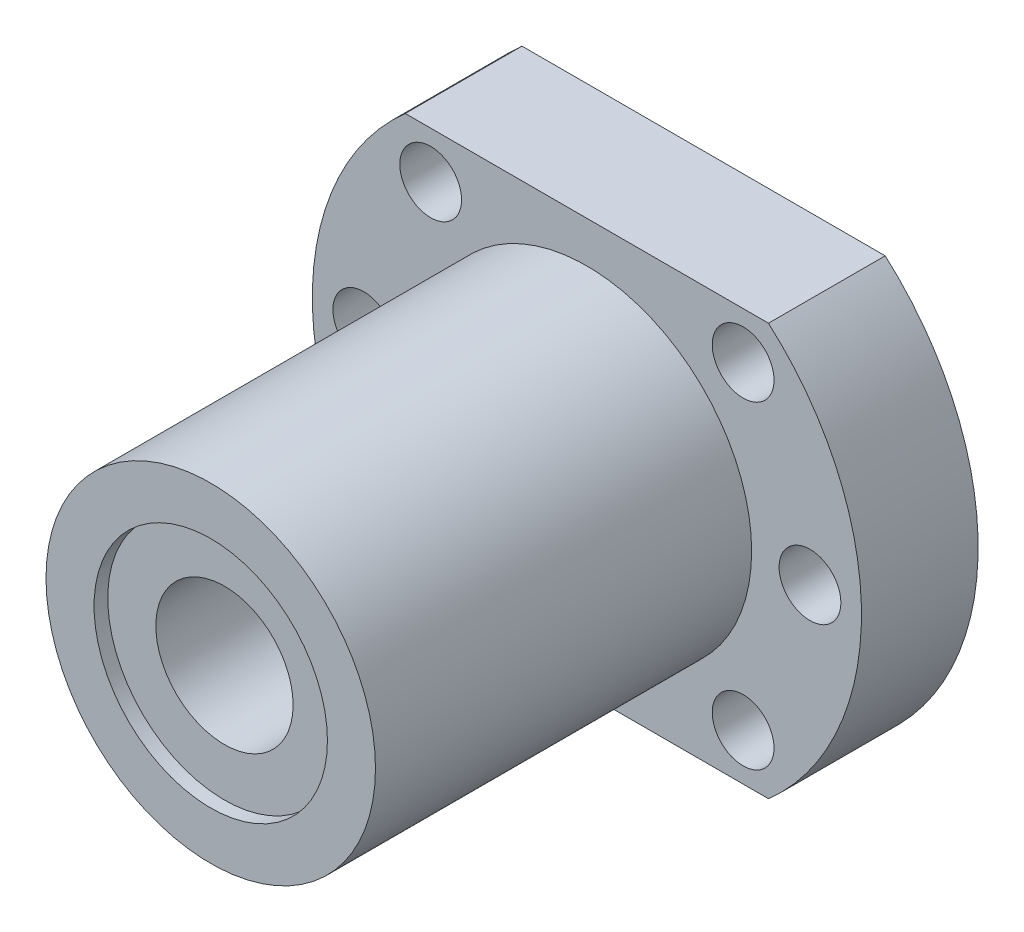
ISO-10303-21;
HEADER;
FILE_DESCRIPTION(('STEP AP214'),'2;1');
FILE_NAME('part.step','',(''),(''),'','','');
FILE_SCHEMA(('AUTOMOTIVE_DESIGN { 1 0 10303 214 1 1 1 1 }'));
ENDSEC;
DATA;
#1=APPLICATION_CONTEXT('core data for automotive mechanical design processes');
#2=APPLICATION_PROTOCOL_DEFINITION('international standard','automotive_design',2000,#1);
#3=PRODUCT_CONTEXT('',#1,'mechanical');
#4=PRODUCT('Part','Part','',(#3));
#5=PRODUCT_RELATED_PRODUCT_CATEGORY('part','',(#4));
#6=PRODUCT_DEFINITION_FORMATION('','',#4);
#7=PRODUCT_DEFINITION_CONTEXT('part definition',#1,'design');
#8=PRODUCT_DEFINITION('design','',#6,#7);
#9=PRODUCT_DEFINITION_SHAPE('','',#8);
#10=(LENGTH_UNIT() NAMED_UNIT(*) SI_UNIT(.MILLI.,.METRE.));
#11=(NAMED_UNIT(*) PLANE_ANGLE_UNIT() SI_UNIT($,.RADIAN.));
#12=(NAMED_UNIT(*) SI_UNIT($,.STERADIAN.) SOLID_ANGLE_UNIT());
#13=UNCERTAINTY_MEASURE_WITH_UNIT(LENGTH_MEASURE(1.E-05),#10,'distance_accuracy_value','');
#14=(GEOMETRIC_REPRESENTATION_CONTEXT(3) GLOBAL_UNCERTAINTY_ASSIGNED_CONTEXT((#13)) GLOBAL_UNIT_ASSIGNED_CONTEXT((#10,
#11,#12)) REPRESENTATION_CONTEXT('',''));
#15=CARTESIAN_POINT('',(0.,0.,0.));
#16=DIRECTION('',(0.,0.,1.));
#17=DIRECTION('',(1.,0.,0.));
#18=AXIS2_PLACEMENT_3D('',#15,#16,#17);
#19=CARTESIAN_POINT('',(0.,0.,-14.142135623731));
#20=DIRECTION('',(0.,0.,1.));
#21=DIRECTION('',(0.999999999999998,0.,0.));
#22=AXIS2_PLACEMENT_3D('',#19,#20,#21);
#23=CYLINDRICAL_SURFACE('',#22,5.);
#24=CARTESIAN_POINT('',(-1.11022302462516E-13,0.,34.9));
#25=DIRECTION('',(0.,0.,1.));
#26=DIRECTION('',(0.999999999999998,0.,0.));
#27=AXIS2_PLACEMENT_3D('',#24,#25,#26);
#28=CIRCLE('',#27,5.);
#29=CARTESIAN_POINT('',(4.99999999999988,0.,34.9));
#30=VERTEX_POINT('',#29);
#31=EDGE_CURVE('E116',#30,#30,#28,.F.);
#32=ORIENTED_EDGE('',*,*,#31,.F.);
#33=EDGE_LOOP('',(#32));
#34=FACE_BOUND('',#33,.T.);
#35=CARTESIAN_POINT('',(0.,0.,1.));
#36=DIRECTION('',(0.,0.,-1.));
#37=DIRECTION('',(-0.999999999999998,0.,0.));
#38=AXIS2_PLACEMENT_3D('',#35,#36,#37);
#39=CIRCLE('',#38,5.);
#40=CARTESIAN_POINT('',(-4.99999999999999,0.,1.));
#41=VERTEX_POINT('',#40);
#42=EDGE_CURVE('E42',#41,#41,#39,.F.);
#43=ORIENTED_EDGE('',*,*,#42,.F.);
#44=EDGE_LOOP('',(#43));
#45=FACE_BOUND('',#44,.T.);
#46=ADVANCED_FACE('F38',(#34,#45),#23,.F.);
#47=CARTESIAN_POINT('',(0.,0.,8.50000000000001));
#48=DIRECTION('',(0.,0.,-1.));
#49=DIRECTION('',(-0.999999999999998,0.,0.));
#50=AXIS2_PLACEMENT_3D('',#47,#48,#49);
#51=CYLINDRICAL_SURFACE('',#50,20.);
#52=CARTESIAN_POINT('',(0.,0.,0.));
#53=DIRECTION('',(0.,0.,1.));
#54=DIRECTION('',(0.999999999999998,0.,0.));
#55=AXIS2_PLACEMENT_3D('',#52,#53,#54);
#56=CIRCLE('',#55,20.);
#57=CARTESIAN_POINT('',(-13.228756555323,15.,0.));
#58=VERTEX_POINT('',#57);
#59=CARTESIAN_POINT('',(-13.2287565553229,-15.,0.));
#60=VERTEX_POINT('',#59);
#61=EDGE_CURVE('E107',#58,#60,#56,.T.);
#62=ORIENTED_EDGE('',*,*,#61,.T.);
#63=DIRECTION('',(0.,0.,-1.));
#64=VECTOR('',#63,1.);
#65=CARTESIAN_POINT('',(-13.228756555323,-15.,8.50000000000001));
#66=LINE('',#65,#64);
#67=CARTESIAN_POINT('',(-13.228756555323,-15.,8.50000000000001));
#68=VERTEX_POINT('',#67);
#69=EDGE_CURVE('E48',#68,#60,#66,.T.);
#70=ORIENTED_EDGE('',*,*,#69,.F.);
#71=CARTESIAN_POINT('',(0.,0.,8.50000000000001));
#72=DIRECTION('',(0.,0.,1.));
#73=DIRECTION('',(0.999999999999998,0.,0.));
#74=AXIS2_PLACEMENT_3D('',#71,#72,#73);
#75=CIRCLE('',#74,20.);
#76=CARTESIAN_POINT('',(-13.228756555323,15.,8.50000000000001));
#77=VERTEX_POINT('',#76);
#78=EDGE_CURVE('E93',#77,#68,#75,.T.);
#79=ORIENTED_EDGE('',*,*,#78,.F.);
#80=DIRECTION('',(0.,0.,-1.));
#81=VECTOR('',#80,1.);
#82=CARTESIAN_POINT('',(-13.228756555323,15.,8.50000000000001));
#83=LINE('',#82,#81);
#84=EDGE_CURVE('E103',#77,#58,#83,.T.);
#85=ORIENTED_EDGE('',*,*,#84,.T.);
#86=EDGE_LOOP('',(#62,#70,#79,#85));
#87=FACE_BOUND('',#86,.T.);
#88=ADVANCED_FACE('F40',(#87),#51,.T.);
#89=CARTESIAN_POINT('',(-13.228756555323,-15.,8.50000000000001));
#90=DIRECTION('',(0.,0.999999999999998,0.));
#91=DIRECTION('',(0.,0.,1.));
#92=AXIS2_PLACEMENT_3D('',#89,#90,#91);
#93=PLANE('',#92);
#94=DIRECTION('',(0.999999999999998,0.,0.));
#95=VECTOR('',#94,1.);
#96=CARTESIAN_POINT('',(-13.2287565553229,-15.,0.));
#97=LINE('',#96,#95);
#98=CARTESIAN_POINT('',(13.2287565553229,-15.,2.22044604925031E-13));
#99=VERTEX_POINT('',#98);
#100=EDGE_CURVE('E98',#60,#99,#97,.T.);
#101=ORIENTED_EDGE('',*,*,#100,.T.);
#102=DIRECTION('',(0.,0.,-1.));
#103=VECTOR('',#102,1.);
#104=CARTESIAN_POINT('',(13.2287565553229,-15.,8.50000000000023));
#105=LINE('',#104,#103);
#106=CARTESIAN_POINT('',(13.2287565553229,-15.,8.50000000000023));
#107=VERTEX_POINT('',#106);
#108=EDGE_CURVE('E96',#107,#99,#105,.T.);
#109=ORIENTED_EDGE('',*,*,#108,.F.);
#110=DIRECTION('',(0.999999999999998,0.,0.));
#111=VECTOR('',#110,1.);
#112=CARTESIAN_POINT('',(-13.228756555323,-15.,8.50000000000001));
#113=LINE('',#112,#111);
#114=EDGE_CURVE('E88',#68,#107,#113,.T.);
#115=ORIENTED_EDGE('',*,*,#114,.F.);
#116=ORIENTED_EDGE('',*,*,#69,.T.);
#117=EDGE_LOOP('',(#101,#109,#115,#116));
#118=FACE_BOUND('',#117,.T.);
#119=ADVANCED_FACE('F97',(#118),#93,.F.);
#120=CARTESIAN_POINT('',(0.,0.,8.50000000000001));
#121=DIRECTION('',(0.,0.,-1.));
#122=DIRECTION('',(-0.999999999999998,0.,0.));
#123=AXIS2_PLACEMENT_3D('',#120,#121,#122);
#124=CYLINDRICAL_SURFACE('',#123,20.);
#125=CARTESIAN_POINT('',(0.,0.,0.));
#126=DIRECTION('',(0.,0.,1.));
#127=DIRECTION('',(-0.999999999999998,0.,0.));
#128=AXIS2_PLACEMENT_3D('',#125,#126,#127);
#129=CIRCLE('',#128,20.);
#130=CARTESIAN_POINT('',(13.228756555323,15.,2.22044604925031E-13));
#131=VERTEX_POINT('',#130);
#132=EDGE_CURVE('E74',#99,#131,#129,.T.);
#133=ORIENTED_EDGE('',*,*,#132,.T.);
#134=DIRECTION('',(0.,0.,-1.));
#135=VECTOR('',#134,1.);
#136=CARTESIAN_POINT('',(13.228756555323,15.,8.50000000000017));
#137=LINE('',#136,#135);
#138=CARTESIAN_POINT('',(13.228756555323,15.,8.50000000000017));
#139=VERTEX_POINT('',#138);
#140=EDGE_CURVE('E99',#139,#131,#137,.T.);
#141=ORIENTED_EDGE('',*,*,#140,.F.);
#142=CARTESIAN_POINT('',(0.,0.,8.50000000000001));
#143=DIRECTION('',(0.,0.,1.));
#144=DIRECTION('',(-0.999999999999998,0.,0.));
#145=AXIS2_PLACEMENT_3D('',#142,#143,#144);
#146=CIRCLE('',#145,20.);
#147=EDGE_CURVE('E91',#107,#139,#146,.T.);
#148=ORIENTED_EDGE('',*,*,#147,.F.);
#149=ORIENTED_EDGE('',*,*,#108,.T.);
#150=EDGE_LOOP('',(#133,#141,#148,#149));
#151=FACE_BOUND('',#150,.T.);
#152=ADVANCED_FACE('F101',(#151),#124,.T.);
#153=CARTESIAN_POINT('',(-13.228756555323,15.,8.50000000000001));
#154=DIRECTION('',(0.,-0.999999999999998,0.));
#155=DIRECTION('',(0.,0.,-1.));
#156=AXIS2_PLACEMENT_3D('',#153,#154,#155);
#157=PLANE('',#156);
#158=DIRECTION('',(-0.999999999999998,0.,0.));
#159=VECTOR('',#158,1.);
#160=CARTESIAN_POINT('',(-13.228756555323,15.,0.));
#161=LINE('',#160,#159);
#162=EDGE_CURVE('E80',#131,#58,#161,.T.);
#163=ORIENTED_EDGE('',*,*,#162,.T.);
#164=ORIENTED_EDGE('',*,*,#84,.F.);
#165=DIRECTION('',(-0.999999999999998,0.,0.));
#166=VECTOR('',#165,1.);
#167=CARTESIAN_POINT('',(-13.228756555323,15.,8.50000000000001));
#168=LINE('',#167,#166);
#169=EDGE_CURVE('E57',#139,#77,#168,.T.);
#170=ORIENTED_EDGE('',*,*,#169,.F.);
#171=ORIENTED_EDGE('',*,*,#140,.T.);
#172=EDGE_LOOP('',(#163,#164,#170,#171));
#173=FACE_BOUND('',#172,.T.);
#174=ADVANCED_FACE('F189',(#173),#157,.F.);
#175=CARTESIAN_POINT('',(0.,0.,8.50000000000001));
#176=DIRECTION('',(0.,0.,1.));
#177=DIRECTION('',(0.999999999999998,0.,0.));
#178=AXIS2_PLACEMENT_3D('',#175,#176,#177);
#179=PLANE('',#178);
#180=CARTESIAN_POINT('',(-16.25,0.,8.50000000000001));
#181=DIRECTION('',(0.,0.,1.));
#182=DIRECTION('',(0.999999999999998,0.,0.));
#183=AXIS2_PLACEMENT_3D('',#180,#181,#182);
#184=CIRCLE('',#183,2.25);
#185=CARTESIAN_POINT('',(-14.,0.,8.50000000000001));
#186=VERTEX_POINT('',#185);
#187=EDGE_CURVE('E143',#186,#186,#184,.F.);
#188=ORIENTED_EDGE('',*,*,#187,.T.);
#189=EDGE_LOOP('',(#188));
#190=FACE_BOUND('',#189,.T.);
#191=CARTESIAN_POINT('',(-11.3799165199047,11.6,8.50000000000017));
#192=DIRECTION('',(0.,0.,1.));
#193=DIRECTION('',(0.999999999999998,0.,0.));
#194=AXIS2_PLACEMENT_3D('',#191,#192,#193);
#195=CIRCLE('',#194,2.25);
#196=CARTESIAN_POINT('',(-9.12991651990469,11.6,8.50000000000017));
#197=VERTEX_POINT('',#196);
#198=EDGE_CURVE('E158',#197,#197,#195,.F.);
#199=ORIENTED_EDGE('',*,*,#198,.T.);
#200=EDGE_LOOP('',(#199));
#201=FACE_BOUND('',#200,.T.);
#202=CARTESIAN_POINT('',(11.3799165199047,-11.6,8.50000000000001));
#203=DIRECTION('',(0.,0.,1.));
#204=DIRECTION('',(0.999999999999998,0.,0.));
#205=AXIS2_PLACEMENT_3D('',#202,#203,#204);
#206=CIRCLE('',#205,2.25);
#207=CARTESIAN_POINT('',(13.6299165199047,-11.6,8.50000000000001));
#208=VERTEX_POINT('',#207);
#209=EDGE_CURVE('E152',#208,#208,#206,.F.);
#210=ORIENTED_EDGE('',*,*,#209,.T.);
#211=EDGE_LOOP('',(#210));
#212=FACE_BOUND('',#211,.T.);
#213=CARTESIAN_POINT('',(16.2499999999998,0.,8.50000000000001));
#214=DIRECTION('',(0.,0.,1.));
#215=DIRECTION('',(0.999999999999998,0.,0.));
#216=AXIS2_PLACEMENT_3D('',#213,#214,#215);
#217=CIRCLE('',#216,2.25);
#218=CARTESIAN_POINT('',(18.4999999999998,0.,8.50000000000001));
#219=VERTEX_POINT('',#218);
#220=EDGE_CURVE('E144',#219,#219,#217,.F.);
#221=ORIENTED_EDGE('',*,*,#220,.T.);
#222=EDGE_LOOP('',(#221));
#223=FACE_BOUND('',#222,.T.);
#224=CARTESIAN_POINT('',(11.3799165199047,11.6,8.50000000000001));
#225=DIRECTION('',(0.,0.,1.));
#226=DIRECTION('',(0.999999999999998,0.,0.));
#227=AXIS2_PLACEMENT_3D('',#224,#225,#226);
#228=CIRCLE('',#227,2.25);
#229=CARTESIAN_POINT('',(13.6299165199047,11.6,8.50000000000001));
#230=VERTEX_POINT('',#229);
#231=EDGE_CURVE('E151',#230,#230,#228,.F.);
#232=ORIENTED_EDGE('',*,*,#231,.T.);
#233=EDGE_LOOP('',(#232));
#234=FACE_BOUND('',#233,.T.);
#235=CARTESIAN_POINT('',(-11.3799165199047,-11.6,8.50000000000017));
#236=DIRECTION('',(0.,0.,1.));
#237=DIRECTION('',(0.999999999999998,0.,0.));
#238=AXIS2_PLACEMENT_3D('',#235,#236,#237);
#239=CIRCLE('',#238,2.25);
#240=CARTESIAN_POINT('',(-9.12991651990472,-11.6,8.50000000000017));
#241=VERTEX_POINT('',#240);
#242=EDGE_CURVE('E135',#241,#241,#239,.F.);
#243=ORIENTED_EDGE('',*,*,#242,.T.);
#244=EDGE_LOOP('',(#243));
#245=FACE_BOUND('',#244,.T.);
#246=CARTESIAN_POINT('',(0.,0.,8.50000000000001));
#247=DIRECTION('',(0.,0.,1.));
#248=DIRECTION('',(0.999999999999998,0.,0.));
#249=AXIS2_PLACEMENT_3D('',#246,#247,#248);
#250=CIRCLE('',#249,12.);
#251=CARTESIAN_POINT('',(12.,0.,8.50000000000001));
#252=VERTEX_POINT('',#251);
#253=EDGE_CURVE('E11',#252,#252,#250,.T.);
#254=ORIENTED_EDGE('',*,*,#253,.F.);
#255=EDGE_LOOP('',(#254));
#256=FACE_BOUND('',#255,.T.);
#257=ORIENTED_EDGE('',*,*,#78,.T.);
#258=ORIENTED_EDGE('',*,*,#114,.T.);
#259=ORIENTED_EDGE('',*,*,#147,.T.);
#260=ORIENTED_EDGE('',*,*,#169,.T.);
#261=EDGE_LOOP('',(#257,#258,#259,#260));
#262=FACE_BOUND('',#261,.T.);
#263=ADVANCED_FACE('F89',(#190,#201,#212,#223,#234,#245,#256,#262),#179,.T.);
#264=CARTESIAN_POINT('',(0.,0.,0.));
#265=DIRECTION('',(0.,0.,1.));
#266=DIRECTION('',(0.999999999999998,0.,0.));
#267=AXIS2_PLACEMENT_3D('',#264,#265,#266);
#268=PLANE('',#267);
#269=CARTESIAN_POINT('',(-16.25,0.,0.));
#270=DIRECTION('',(0.,0.,-1.));
#271=DIRECTION('',(-0.999999999999998,0.,0.));
#272=AXIS2_PLACEMENT_3D('',#269,#270,#271);
#273=CIRCLE('',#272,2.25);
#274=CARTESIAN_POINT('',(-18.5,0.,0.));
#275=VERTEX_POINT('',#274);
#276=EDGE_CURVE('E161',#275,#275,#273,.T.);
#277=ORIENTED_EDGE('',*,*,#276,.F.);
#278=EDGE_LOOP('',(#277));
#279=FACE_BOUND('',#278,.T.);
#280=CARTESIAN_POINT('',(-11.3799165199047,11.6,2.22044604925031E-13));
#281=DIRECTION('',(0.,0.,-1.));
#282=DIRECTION('',(-0.999999999999998,0.,0.));
#283=AXIS2_PLACEMENT_3D('',#280,#281,#282);
#284=CIRCLE('',#283,2.25);
#285=CARTESIAN_POINT('',(-13.6299165199047,11.6,2.22044604925031E-13));
#286=VERTEX_POINT('',#285);
#287=EDGE_CURVE('E155',#286,#286,#284,.T.);
#288=ORIENTED_EDGE('',*,*,#287,.F.);
#289=EDGE_LOOP('',(#288));
#290=FACE_BOUND('',#289,.T.);
#291=CARTESIAN_POINT('',(11.3799165199047,-11.6,0.));
#292=DIRECTION('',(0.,0.,-1.));
#293=DIRECTION('',(0.999999999999998,0.,0.));
#294=AXIS2_PLACEMENT_3D('',#291,#292,#293);
#295=CIRCLE('',#294,2.25);
#296=CARTESIAN_POINT('',(13.6299165199047,-11.6,0.));
#297=VERTEX_POINT('',#296);
#298=EDGE_CURVE('E147',#297,#297,#295,.T.);
#299=ORIENTED_EDGE('',*,*,#298,.F.);
#300=EDGE_LOOP('',(#299));
#301=FACE_BOUND('',#300,.T.);
#302=CARTESIAN_POINT('',(16.2499999999998,0.,0.));
#303=DIRECTION('',(0.,0.,-1.));
#304=DIRECTION('',(0.999999999999998,0.,0.));
#305=AXIS2_PLACEMENT_3D('',#302,#303,#304);
#306=CIRCLE('',#305,2.25);
#307=CARTESIAN_POINT('',(18.4999999999998,0.,0.));
#308=VERTEX_POINT('',#307);
#309=EDGE_CURVE('E148',#308,#308,#306,.T.);
#310=ORIENTED_EDGE('',*,*,#309,.F.);
#311=EDGE_LOOP('',(#310));
#312=FACE_BOUND('',#311,.T.);
#313=CARTESIAN_POINT('',(11.3799165199047,11.6,0.));
#314=DIRECTION('',(0.,0.,-1.));
#315=DIRECTION('',(0.999999999999998,0.,0.));
#316=AXIS2_PLACEMENT_3D('',#313,#314,#315);
#317=CIRCLE('',#316,2.25);
#318=CARTESIAN_POINT('',(13.6299165199047,11.6,0.));
#319=VERTEX_POINT('',#318);
#320=EDGE_CURVE('E170',#319,#319,#317,.T.);
#321=ORIENTED_EDGE('',*,*,#320,.F.);
#322=EDGE_LOOP('',(#321));
#323=FACE_BOUND('',#322,.T.);
#324=CARTESIAN_POINT('',(-11.3799165199047,-11.6,2.22044604925031E-13));
#325=DIRECTION('',(0.,0.,-1.));
#326=DIRECTION('',(-0.999999999999998,0.,0.));
#327=AXIS2_PLACEMENT_3D('',#324,#325,#326);
#328=CIRCLE('',#327,2.25);
#329=CARTESIAN_POINT('',(-13.6299165199047,-11.6,2.22044604925031E-13));
#330=VERTEX_POINT('',#329);
#331=EDGE_CURVE('E140',#330,#330,#328,.T.);
#332=ORIENTED_EDGE('',*,*,#331,.F.);
#333=EDGE_LOOP('',(#332));
#334=FACE_BOUND('',#333,.T.);
#335=CARTESIAN_POINT('',(0.,0.,0.));
#336=DIRECTION('',(0.,0.,-1.));
#337=DIRECTION('',(-0.999999999999998,0.,0.));
#338=AXIS2_PLACEMENT_3D('',#335,#336,#337);
#339=CIRCLE('',#338,8.5);
#340=CARTESIAN_POINT('',(-8.49999999999999,0.,0.));
#341=VERTEX_POINT('',#340);
#342=EDGE_CURVE('E131',#341,#341,#339,.T.);
#343=ORIENTED_EDGE('',*,*,#342,.F.);
#344=EDGE_LOOP('',(#343));
#345=FACE_BOUND('',#344,.T.);
#346=ORIENTED_EDGE('',*,*,#61,.F.);
#347=ORIENTED_EDGE('',*,*,#162,.F.);
#348=ORIENTED_EDGE('',*,*,#132,.F.);
#349=ORIENTED_EDGE('',*,*,#100,.F.);
#350=EDGE_LOOP('',(#346,#347,#348,#349));
#351=FACE_BOUND('',#350,.T.);
#352=ADVANCED_FACE('F177',(#279,#290,#301,#312,#323,#334,#345,#351),#268,.F.);
#353=CARTESIAN_POINT('',(0.,0.,35.9));
#354=DIRECTION('',(0.,0.,-1.));
#355=DIRECTION('',(-0.999999999999998,0.,0.));
#356=AXIS2_PLACEMENT_3D('',#353,#354,#355);
#357=CYLINDRICAL_SURFACE('',#356,12.);
#358=CARTESIAN_POINT('',(0.,0.,35.9));
#359=DIRECTION('',(0.,0.,1.));
#360=DIRECTION('',(0.999999999999998,0.,0.));
#361=AXIS2_PLACEMENT_3D('',#358,#359,#360);
#362=CIRCLE('',#361,12.);
#363=CARTESIAN_POINT('',(12.,0.,35.9));
#364=VERTEX_POINT('',#363);
#365=EDGE_CURVE('E110',#364,#364,#362,.T.);
#366=ORIENTED_EDGE('',*,*,#365,.F.);
#367=EDGE_LOOP('',(#366));
#368=FACE_BOUND('',#367,.T.);
#369=ORIENTED_EDGE('',*,*,#253,.T.);
#370=EDGE_LOOP('',(#369));
#371=FACE_BOUND('',#370,.T.);
#372=ADVANCED_FACE('F180',(#368,#371),#357,.T.);
#373=CARTESIAN_POINT('',(0.,0.,35.9));
#374=DIRECTION('',(0.,0.,1.));
#375=DIRECTION('',(0.999999999999998,0.,0.));
#376=AXIS2_PLACEMENT_3D('',#373,#374,#375);
#377=PLANE('',#376);
#378=CARTESIAN_POINT('',(0.,0.,35.9));
#379=DIRECTION('',(0.,0.,1.));
#380=DIRECTION('',(0.999999999999998,0.,0.));
#381=AXIS2_PLACEMENT_3D('',#378,#379,#380);
#382=CIRCLE('',#381,8.5);
#383=CARTESIAN_POINT('',(8.49999999999999,0.,35.9));
#384=VERTEX_POINT('',#383);
#385=EDGE_CURVE('E124',#384,#384,#382,.T.);
#386=ORIENTED_EDGE('',*,*,#385,.F.);
#387=EDGE_LOOP('',(#386));
#388=FACE_BOUND('',#387,.T.);
#389=ORIENTED_EDGE('',*,*,#365,.T.);
#390=EDGE_LOOP('',(#389));
#391=FACE_BOUND('',#390,.T.);
#392=ADVANCED_FACE('F210',(#388,#391),#377,.T.);
#393=CARTESIAN_POINT('',(-1.11022302462516E-13,0.,34.9));
#394=DIRECTION('',(0.,0.,1.));
#395=DIRECTION('',(0.999999999999998,0.,0.));
#396=AXIS2_PLACEMENT_3D('',#393,#394,#395);
#397=PLANE('',#396);
#398=CARTESIAN_POINT('',(-1.11022302462516E-13,0.,34.9));
#399=DIRECTION('',(0.,0.,1.));
#400=DIRECTION('',(0.999999999999998,0.,0.));
#401=AXIS2_PLACEMENT_3D('',#398,#399,#400);
#402=CIRCLE('',#401,8.5);
#403=CARTESIAN_POINT('',(8.49999999999987,0.,34.9));
#404=VERTEX_POINT('',#403);
#405=EDGE_CURVE('E118',#404,#404,#402,.T.);
#406=ORIENTED_EDGE('',*,*,#405,.T.);
#407=EDGE_LOOP('',(#406));
#408=FACE_BOUND('',#407,.T.);
#409=ORIENTED_EDGE('',*,*,#31,.T.);
#410=EDGE_LOOP('',(#409));
#411=FACE_BOUND('',#410,.T.);
#412=ADVANCED_FACE('F213',(#408,#411),#397,.T.);
#413=CARTESIAN_POINT('',(-1.11022302462516E-13,0.,34.9));
#414=DIRECTION('',(0.,0.,1.));
#415=DIRECTION('',(0.999999999999998,0.,0.));
#416=AXIS2_PLACEMENT_3D('',#413,#414,#415);
#417=CYLINDRICAL_SURFACE('',#416,8.5);
#418=ORIENTED_EDGE('',*,*,#405,.F.);
#419=EDGE_LOOP('',(#418));
#420=FACE_BOUND('',#419,.T.);
#421=ORIENTED_EDGE('',*,*,#385,.T.);
#422=EDGE_LOOP('',(#421));
#423=FACE_BOUND('',#422,.T.);
#424=ADVANCED_FACE('F208',(#420,#423),#417,.F.);
#425=CARTESIAN_POINT('',(0.,0.,1.));
#426=DIRECTION('',(0.,0.,-1.));
#427=DIRECTION('',(-0.999999999999998,0.,0.));
#428=AXIS2_PLACEMENT_3D('',#425,#426,#427);
#429=PLANE('',#428);
#430=CARTESIAN_POINT('',(0.,0.,1.));
#431=DIRECTION('',(0.,0.,-1.));
#432=DIRECTION('',(-0.999999999999998,0.,0.));
#433=AXIS2_PLACEMENT_3D('',#430,#431,#432);
#434=CIRCLE('',#433,8.5);
#435=CARTESIAN_POINT('',(-8.49999999999999,0.,1.));
#436=VERTEX_POINT('',#435);
#437=EDGE_CURVE('E134',#436,#436,#434,.T.);
#438=ORIENTED_EDGE('',*,*,#437,.T.);
#439=EDGE_LOOP('',(#438));
#440=FACE_BOUND('',#439,.T.);
#441=ORIENTED_EDGE('',*,*,#42,.T.);
#442=EDGE_LOOP('',(#441));
#443=FACE_BOUND('',#442,.T.);
#444=ADVANCED_FACE('F241',(#440,#443),#429,.T.);
#445=CARTESIAN_POINT('',(0.,0.,1.));
#446=DIRECTION('',(0.,0.,-1.));
#447=DIRECTION('',(-0.999999999999998,0.,0.));
#448=AXIS2_PLACEMENT_3D('',#445,#446,#447);
#449=CYLINDRICAL_SURFACE('',#448,8.5);
#450=ORIENTED_EDGE('',*,*,#437,.F.);
#451=EDGE_LOOP('',(#450));
#452=FACE_BOUND('',#451,.T.);
#453=ORIENTED_EDGE('',*,*,#342,.T.);
#454=EDGE_LOOP('',(#453));
#455=FACE_BOUND('',#454,.T.);
#456=ADVANCED_FACE('F248',(#452,#455),#449,.F.);
#457=CARTESIAN_POINT('',(-11.3799165199048,-11.6,14.8639610306791));
#458=DIRECTION('',(0.,0.,-1.));
#459=DIRECTION('',(-0.999999999999998,0.,0.));
#460=AXIS2_PLACEMENT_3D('',#457,#458,#459);
#461=CYLINDRICAL_SURFACE('',#460,2.25);
#462=ORIENTED_EDGE('',*,*,#331,.T.);
#463=EDGE_LOOP('',(#462));
#464=FACE_BOUND('',#463,.T.);
#465=ORIENTED_EDGE('',*,*,#242,.F.);
#466=EDGE_LOOP('',(#465));
#467=FACE_BOUND('',#466,.T.);
#468=ADVANCED_FACE('F256',(#464,#467),#461,.F.);
#469=CARTESIAN_POINT('',(11.3799165199047,11.6,14.8639610306789));
#470=DIRECTION('',(0.,0.,-1.));
#471=DIRECTION('',(-0.999999999999998,0.,0.));
#472=AXIS2_PLACEMENT_3D('',#469,#470,#471);
#473=CYLINDRICAL_SURFACE('',#472,2.25);
#474=ORIENTED_EDGE('',*,*,#320,.T.);
#475=EDGE_LOOP('',(#474));
#476=FACE_BOUND('',#475,.T.);
#477=ORIENTED_EDGE('',*,*,#231,.F.);
#478=EDGE_LOOP('',(#477));
#479=FACE_BOUND('',#478,.T.);
#480=ADVANCED_FACE('F174',(#476,#479),#473,.F.);
#481=CARTESIAN_POINT('',(16.2499999999999,0.,14.8639610306789));
#482=DIRECTION('',(0.,0.,-1.));
#483=DIRECTION('',(-0.999999999999998,0.,0.));
#484=AXIS2_PLACEMENT_3D('',#481,#482,#483);
#485=CYLINDRICAL_SURFACE('',#484,2.25);
#486=ORIENTED_EDGE('',*,*,#309,.T.);
#487=EDGE_LOOP('',(#486));
#488=FACE_BOUND('',#487,.T.);
#489=ORIENTED_EDGE('',*,*,#220,.F.);
#490=EDGE_LOOP('',(#489));
#491=FACE_BOUND('',#490,.T.);
#492=ADVANCED_FACE('F271',(#488,#491),#485,.F.);
#493=CARTESIAN_POINT('',(11.3799165199047,-11.6,14.8639610306789));
#494=DIRECTION('',(0.,0.,-1.));
#495=DIRECTION('',(-0.999999999999998,0.,0.));
#496=AXIS2_PLACEMENT_3D('',#493,#494,#495);
#497=CYLINDRICAL_SURFACE('',#496,2.25);
#498=ORIENTED_EDGE('',*,*,#298,.T.);
#499=EDGE_LOOP('',(#498));
#500=FACE_BOUND('',#499,.T.);
#501=ORIENTED_EDGE('',*,*,#209,.F.);
#502=EDGE_LOOP('',(#501));
#503=FACE_BOUND('',#502,.T.);
#504=ADVANCED_FACE('F278',(#500,#503),#497,.F.);
#505=CARTESIAN_POINT('',(-11.3799165199047,11.6,14.8639610306791));
#506=DIRECTION('',(0.,0.,-1.));
#507=DIRECTION('',(-0.999999999999998,0.,0.));
#508=AXIS2_PLACEMENT_3D('',#505,#506,#507);
#509=CYLINDRICAL_SURFACE('',#508,2.25);
#510=ORIENTED_EDGE('',*,*,#287,.T.);
#511=EDGE_LOOP('',(#510));
#512=FACE_BOUND('',#511,.T.);
#513=ORIENTED_EDGE('',*,*,#198,.F.);
#514=EDGE_LOOP('',(#513));
#515=FACE_BOUND('',#514,.T.);
#516=ADVANCED_FACE('F286',(#512,#515),#509,.F.);
#517=CARTESIAN_POINT('',(-16.2500000000001,0.,14.8639610306789));
#518=DIRECTION('',(0.,0.,-1.));
#519=DIRECTION('',(-0.999999999999998,0.,0.));
#520=AXIS2_PLACEMENT_3D('',#517,#518,#519);
#521=CYLINDRICAL_SURFACE('',#520,2.25);
#522=ORIENTED_EDGE('',*,*,#276,.T.);
#523=EDGE_LOOP('',(#522));
#524=FACE_BOUND('',#523,.T.);
#525=ORIENTED_EDGE('',*,*,#187,.F.);
#526=EDGE_LOOP('',(#525));
#527=FACE_BOUND('',#526,.T.);
#528=ADVANCED_FACE('F294',(#524,#527),#521,.F.);
#529=CLOSED_SHELL('',(#46,#88,#119,#152,#174,#263,#352,#372,#392,#412,#424,#444,#456,#468,#480,
#492,#504,#516,#528));
#530=MANIFOLD_SOLID_BREP('B2',#529);
#531=ADVANCED_BREP_SHAPE_REPRESENTATION('',(#18,#530),#14);
#532=SHAPE_DEFINITION_REPRESENTATION(#9,#531);
ENDSEC;
END-ISO-10303-21;
